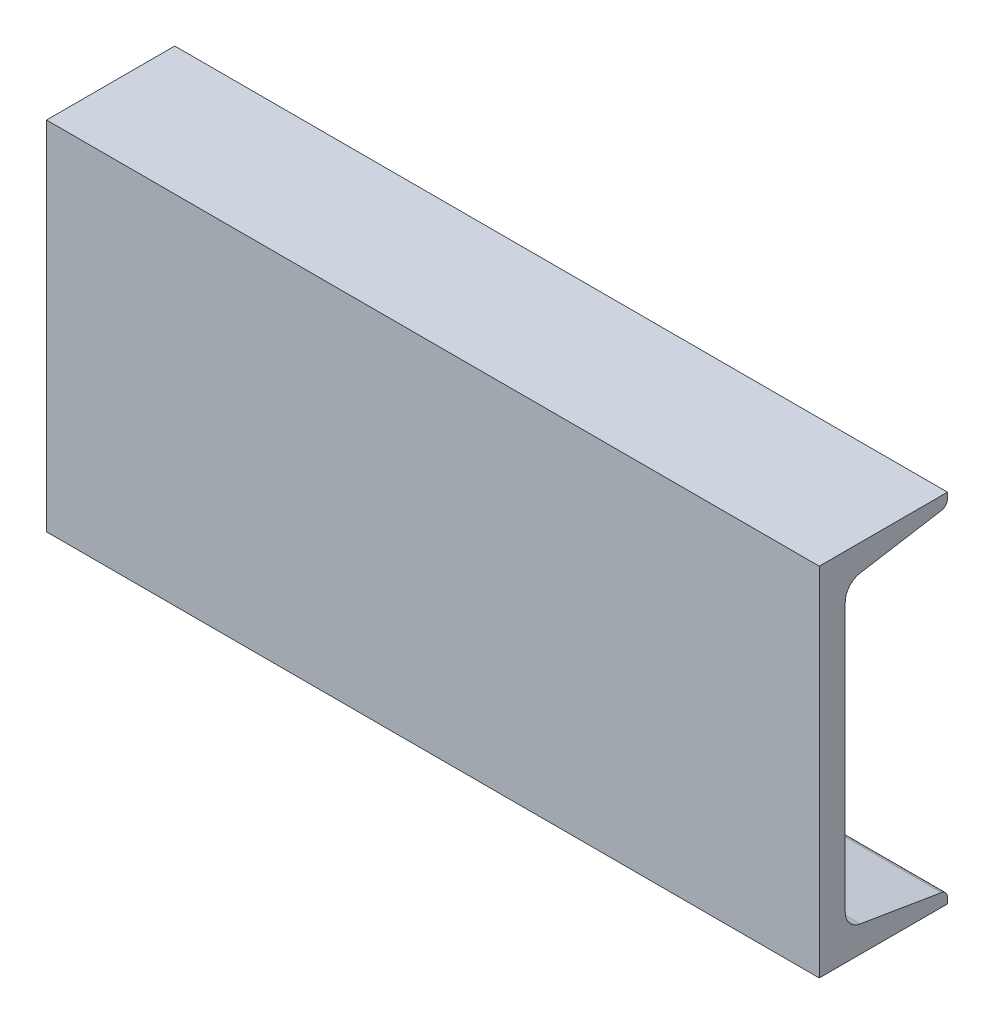
ISO-10303-21;
HEADER;
FILE_DESCRIPTION(('STEP AP214'),'2;1');
FILE_NAME('part.step','',(''),(''),'','','');
FILE_SCHEMA(('AUTOMOTIVE_DESIGN { 1 0 10303 214 1 1 1 1 }'));
ENDSEC;
DATA;
#1=APPLICATION_CONTEXT('core data for automotive mechanical design processes');
#2=APPLICATION_PROTOCOL_DEFINITION('international standard','automotive_design',2000,#1);
#3=PRODUCT_CONTEXT('',#1,'mechanical');
#4=PRODUCT('Part','Part','',(#3));
#5=PRODUCT_RELATED_PRODUCT_CATEGORY('part','',(#4));
#6=PRODUCT_DEFINITION_FORMATION('','',#4);
#7=PRODUCT_DEFINITION_CONTEXT('part definition',#1,'design');
#8=PRODUCT_DEFINITION('design','',#6,#7);
#9=PRODUCT_DEFINITION_SHAPE('','',#8);
#10=(LENGTH_UNIT() NAMED_UNIT(*) SI_UNIT(.MILLI.,.METRE.));
#11=(NAMED_UNIT(*) PLANE_ANGLE_UNIT() SI_UNIT($,.RADIAN.));
#12=(NAMED_UNIT(*) SI_UNIT($,.STERADIAN.) SOLID_ANGLE_UNIT());
#13=UNCERTAINTY_MEASURE_WITH_UNIT(LENGTH_MEASURE(1.E-05),#10,'distance_accuracy_value','');
#14=(GEOMETRIC_REPRESENTATION_CONTEXT(3) GLOBAL_UNCERTAINTY_ASSIGNED_CONTEXT((#13)) GLOBAL_UNIT_ASSIGNED_CONTEXT((#10,
#11,#12)) REPRESENTATION_CONTEXT('',''));
#15=CARTESIAN_POINT('',(0.,0.,0.));
#16=DIRECTION('',(0.,0.,1.));
#17=DIRECTION('',(1.,0.,0.));
#18=AXIS2_PLACEMENT_3D('',#15,#16,#17);
#19=CARTESIAN_POINT('',(165.1,-76.2,27.3939));
#20=DIRECTION('',(0.,1.,0.));
#21=DIRECTION('',(0.,0.,1.));
#22=AXIS2_PLACEMENT_3D('',#19,#20,#21);
#23=PLANE('',#22);
#24=DIRECTION('',(0.,0.,-1.));
#25=VECTOR('',#24,1.);
#26=CARTESIAN_POINT('',(-165.1,-76.2,27.3939));
#27=LINE('',#26,#25);
#28=CARTESIAN_POINT('',(-165.1,-76.2,27.3939));
#29=VERTEX_POINT('',#28);
#30=CARTESIAN_POINT('',(-165.1,-76.2,-27.3939));
#31=VERTEX_POINT('',#30);
#32=EDGE_CURVE('E137',#29,#31,#27,.T.);
#33=ORIENTED_EDGE('',*,*,#32,.T.);
#34=DIRECTION('',(-1.,0.,0.));
#35=VECTOR('',#34,1.);
#36=CARTESIAN_POINT('',(165.1,-76.2,-27.3939));
#37=LINE('',#36,#35);
#38=CARTESIAN_POINT('',(165.1,-76.2,-27.3939));
#39=VERTEX_POINT('',#38);
#40=EDGE_CURVE('E11',#39,#31,#37,.T.);
#41=ORIENTED_EDGE('',*,*,#40,.F.);
#42=DIRECTION('',(0.,0.,-1.));
#43=VECTOR('',#42,1.);
#44=CARTESIAN_POINT('',(165.1,-76.2,27.3939));
#45=LINE('',#44,#43);
#46=CARTESIAN_POINT('',(165.1,-76.2,27.3939));
#47=VERTEX_POINT('',#46);
#48=EDGE_CURVE('E159',#47,#39,#45,.T.);
#49=ORIENTED_EDGE('',*,*,#48,.F.);
#50=DIRECTION('',(-1.,0.,0.));
#51=VECTOR('',#50,1.);
#52=CARTESIAN_POINT('',(165.1,-76.2,27.3939));
#53=LINE('',#52,#51);
#54=EDGE_CURVE('E133',#47,#29,#53,.T.);
#55=ORIENTED_EDGE('',*,*,#54,.T.);
#56=EDGE_LOOP('',(#33,#41,#49,#55));
#57=FACE_BOUND('',#56,.T.);
#58=ADVANCED_FACE('F17',(#57),#23,.F.);
#59=CARTESIAN_POINT('',(165.1,-76.2,-27.3939));
#60=DIRECTION('',(0.,0.,1.));
#61=DIRECTION('',(1.,0.,0.));
#62=AXIS2_PLACEMENT_3D('',#59,#60,#61);
#63=PLANE('',#62);
#64=DIRECTION('',(0.,1.,0.));
#65=VECTOR('',#64,1.);
#66=CARTESIAN_POINT('',(-165.1,-76.2,-27.3939));
#67=LINE('',#66,#65);
#68=CARTESIAN_POINT('',(-165.1,-73.7107446530364,-27.3939));
#69=VERTEX_POINT('',#68);
#70=EDGE_CURVE('E140',#31,#69,#67,.T.);
#71=ORIENTED_EDGE('',*,*,#70,.T.);
#72=DIRECTION('',(-1.,0.,0.));
#73=VECTOR('',#72,1.);
#74=CARTESIAN_POINT('',(165.1,-73.7107446530364,-27.3939));
#75=LINE('',#74,#73);
#76=CARTESIAN_POINT('',(165.1,-73.7107446530364,-27.3939));
#77=VERTEX_POINT('',#76);
#78=EDGE_CURVE('E25',#77,#69,#75,.T.);
#79=ORIENTED_EDGE('',*,*,#78,.F.);
#80=DIRECTION('',(0.,1.,0.));
#81=VECTOR('',#80,1.);
#82=CARTESIAN_POINT('',(165.1,-76.2,-27.3939));
#83=LINE('',#82,#81);
#84=EDGE_CURVE('E88',#39,#77,#83,.T.);
#85=ORIENTED_EDGE('',*,*,#84,.F.);
#86=ORIENTED_EDGE('',*,*,#40,.T.);
#87=EDGE_LOOP('',(#71,#79,#85,#86));
#88=FACE_BOUND('',#87,.T.);
#89=ADVANCED_FACE('F239',(#88),#63,.F.);
#90=CARTESIAN_POINT('',(165.1,-73.7107446530364,-24.3459));
#91=DIRECTION('',(-1.,0.,0.));
#92=DIRECTION('',(0.,0.,1.));
#93=AXIS2_PLACEMENT_3D('',#90,#91,#92);
#94=CYLINDRICAL_SURFACE('',#93,3.048);
#95=CARTESIAN_POINT('',(-165.1,-73.7107446530364,-24.3459));
#96=DIRECTION('',(1.,0.,0.));
#97=DIRECTION('',(0.,0.,-1.));
#98=AXIS2_PLACEMENT_3D('',#95,#96,#97);
#99=CIRCLE('',#98,3.048);
#100=CARTESIAN_POINT('',(-165.1,-70.7042219011292,-24.8470236796088));
#101=VERTEX_POINT('',#100);
#102=EDGE_CURVE('E142',#69,#101,#99,.T.);
#103=ORIENTED_EDGE('',*,*,#102,.T.);
#104=DIRECTION('',(-1.,0.,0.));
#105=VECTOR('',#104,1.);
#106=CARTESIAN_POINT('',(165.1,-70.7042219011292,-24.8470236796088));
#107=LINE('',#106,#105);
#108=CARTESIAN_POINT('',(165.1,-70.7042219011292,-24.8470236796088));
#109=VERTEX_POINT('',#108);
#110=EDGE_CURVE('E178',#109,#101,#107,.T.);
#111=ORIENTED_EDGE('',*,*,#110,.F.);
#112=CARTESIAN_POINT('',(165.1,-73.7107446530364,-24.3459));
#113=DIRECTION('',(1.,0.,0.));
#114=DIRECTION('',(0.,0.,-1.));
#115=AXIS2_PLACEMENT_3D('',#112,#113,#114);
#116=CIRCLE('',#115,3.048);
#117=EDGE_CURVE('E186',#77,#109,#116,.T.);
#118=ORIENTED_EDGE('',*,*,#117,.F.);
#119=ORIENTED_EDGE('',*,*,#78,.T.);
#120=EDGE_LOOP('',(#103,#111,#118,#119));
#121=FACE_BOUND('',#120,.T.);
#122=ADVANCED_FACE('F184',(#121),#94,.T.);
#123=CARTESIAN_POINT('',(165.1,-64.908143628462,9.92690919902199));
#124=DIRECTION('',(0.,-0.986391978972162,0.164410656039631));
#125=DIRECTION('',(0.,-0.164410656039631,-0.986391978972162));
#126=AXIS2_PLACEMENT_3D('',#123,#124,#125);
#127=PLANE('',#126);
#128=DIRECTION('',(0.,0.164410656039631,0.986391978972162));
#129=VECTOR('',#128,1.);
#130=CARTESIAN_POINT('',(-165.1,-64.908143628462,9.92690919902199));
#131=LINE('',#130,#129);
#132=CARTESIAN_POINT('',(-165.1,-64.908143628462,9.92690919902199));
#133=VERTEX_POINT('',#132);
#134=EDGE_CURVE('E144',#101,#133,#131,.T.);
#135=ORIENTED_EDGE('',*,*,#134,.T.);
#136=DIRECTION('',(-1.,0.,0.));
#137=VECTOR('',#136,1.);
#138=CARTESIAN_POINT('',(165.1,-64.908143628462,9.92690919902199));
#139=LINE('',#138,#137);
#140=CARTESIAN_POINT('',(165.1,-64.908143628462,9.92690919902199));
#141=VERTEX_POINT('',#140);
#142=EDGE_CURVE('E175',#141,#133,#139,.T.);
#143=ORIENTED_EDGE('',*,*,#142,.F.);
#144=DIRECTION('',(0.,0.164410656039631,0.986391978972162));
#145=VECTOR('',#144,1.);
#146=CARTESIAN_POINT('',(165.1,-64.908143628462,9.92690919902199));
#147=LINE('',#146,#145);
#148=EDGE_CURVE('E204',#109,#141,#147,.T.);
#149=ORIENTED_EDGE('',*,*,#148,.F.);
#150=ORIENTED_EDGE('',*,*,#110,.T.);
#151=EDGE_LOOP('',(#135,#143,#149,#150));
#152=FACE_BOUND('',#151,.T.);
#153=ADVANCED_FACE('F195',(#152),#127,.F.);
#154=CARTESIAN_POINT('',(165.1,-57.3918367486941,8.6741));
#155=DIRECTION('',(-1.,0.,0.));
#156=DIRECTION('',(0.,0.,1.));
#157=AXIS2_PLACEMENT_3D('',#154,#155,#156);
#158=CYLINDRICAL_SURFACE('',#157,7.62);
#159=CARTESIAN_POINT('',(-165.1,-57.3918367486941,8.6741));
#160=DIRECTION('',(-1.,0.,0.));
#161=DIRECTION('',(0.,0.,-1.));
#162=AXIS2_PLACEMENT_3D('',#159,#160,#161);
#163=CIRCLE('',#162,7.62);
#164=CARTESIAN_POINT('',(-165.1,-57.3918367486941,16.2941));
#165=VERTEX_POINT('',#164);
#166=EDGE_CURVE('E146',#133,#165,#163,.T.);
#167=ORIENTED_EDGE('',*,*,#166,.T.);
#168=DIRECTION('',(-1.,0.,0.));
#169=VECTOR('',#168,1.);
#170=CARTESIAN_POINT('',(165.1,-57.3918367486941,16.2941));
#171=LINE('',#170,#169);
#172=CARTESIAN_POINT('',(165.1,-57.3918367486941,16.2941));
#173=VERTEX_POINT('',#172);
#174=EDGE_CURVE('E172',#173,#165,#171,.T.);
#175=ORIENTED_EDGE('',*,*,#174,.F.);
#176=CARTESIAN_POINT('',(165.1,-57.3918367486941,8.6741));
#177=DIRECTION('',(-1.,0.,0.));
#178=DIRECTION('',(0.,0.,-1.));
#179=AXIS2_PLACEMENT_3D('',#176,#177,#178);
#180=CIRCLE('',#179,7.62);
#181=EDGE_CURVE('E201',#141,#173,#180,.T.);
#182=ORIENTED_EDGE('',*,*,#181,.F.);
#183=ORIENTED_EDGE('',*,*,#142,.T.);
#184=EDGE_LOOP('',(#167,#175,#182,#183));
#185=FACE_BOUND('',#184,.T.);
#186=ADVANCED_FACE('F199',(#185),#158,.F.);
#187=CARTESIAN_POINT('',(165.1,57.3918367486941,16.2941));
#188=DIRECTION('',(0.,0.,1.));
#189=DIRECTION('',(0.,-1.,0.));
#190=AXIS2_PLACEMENT_3D('',#187,#188,#189);
#191=PLANE('',#190);
#192=DIRECTION('',(0.,1.,0.));
#193=VECTOR('',#192,1.);
#194=CARTESIAN_POINT('',(-165.1,57.3918367486941,16.2941));
#195=LINE('',#194,#193);
#196=CARTESIAN_POINT('',(-165.1,57.3918367486941,16.2941));
#197=VERTEX_POINT('',#196);
#198=EDGE_CURVE('E148',#165,#197,#195,.T.);
#199=ORIENTED_EDGE('',*,*,#198,.T.);
#200=DIRECTION('',(-1.,0.,0.));
#201=VECTOR('',#200,1.);
#202=CARTESIAN_POINT('',(165.1,57.3918367486941,16.2941));
#203=LINE('',#202,#201);
#204=CARTESIAN_POINT('',(165.1,57.3918367486941,16.2941));
#205=VERTEX_POINT('',#204);
#206=EDGE_CURVE('E169',#205,#197,#203,.T.);
#207=ORIENTED_EDGE('',*,*,#206,.F.);
#208=DIRECTION('',(0.,1.,0.));
#209=VECTOR('',#208,1.);
#210=CARTESIAN_POINT('',(165.1,57.3918367486941,16.2941));
#211=LINE('',#210,#209);
#212=EDGE_CURVE('E203',#173,#205,#211,.T.);
#213=ORIENTED_EDGE('',*,*,#212,.F.);
#214=ORIENTED_EDGE('',*,*,#174,.T.);
#215=EDGE_LOOP('',(#199,#207,#213,#214));
#216=FACE_BOUND('',#215,.T.);
#217=ADVANCED_FACE('F254',(#216),#191,.F.);
#218=CARTESIAN_POINT('',(165.1,57.3918367486941,8.6741));
#219=DIRECTION('',(-1.,0.,0.));
#220=DIRECTION('',(0.,0.,1.));
#221=AXIS2_PLACEMENT_3D('',#218,#219,#220);
#222=CYLINDRICAL_SURFACE('',#221,7.62);
#223=CARTESIAN_POINT('',(-165.1,57.3918367486941,8.6741));
#224=DIRECTION('',(-1.,0.,0.));
#225=DIRECTION('',(0.,0.,1.));
#226=AXIS2_PLACEMENT_3D('',#223,#224,#225);
#227=CIRCLE('',#226,7.62);
#228=CARTESIAN_POINT('',(-165.1,64.908143628462,9.92690919902198));
#229=VERTEX_POINT('',#228);
#230=EDGE_CURVE('E150',#197,#229,#227,.T.);
#231=ORIENTED_EDGE('',*,*,#230,.T.);
#232=DIRECTION('',(-1.,0.,0.));
#233=VECTOR('',#232,1.);
#234=CARTESIAN_POINT('',(165.1,64.908143628462,9.92690919902198));
#235=LINE('',#234,#233);
#236=CARTESIAN_POINT('',(165.1,64.908143628462,9.92690919902198));
#237=VERTEX_POINT('',#236);
#238=EDGE_CURVE('E166',#237,#229,#235,.T.);
#239=ORIENTED_EDGE('',*,*,#238,.F.);
#240=CARTESIAN_POINT('',(165.1,57.3918367486941,8.6741));
#241=DIRECTION('',(-1.,0.,0.));
#242=DIRECTION('',(0.,0.,1.));
#243=AXIS2_PLACEMENT_3D('',#240,#241,#242);
#244=CIRCLE('',#243,7.62);
#245=EDGE_CURVE('E206',#205,#237,#244,.T.);
#246=ORIENTED_EDGE('',*,*,#245,.F.);
#247=ORIENTED_EDGE('',*,*,#206,.T.);
#248=EDGE_LOOP('',(#231,#239,#246,#247));
#249=FACE_BOUND('',#248,.T.);
#250=ADVANCED_FACE('F257',(#249),#222,.F.);
#251=CARTESIAN_POINT('',(165.1,64.908143628462,9.92690919902198));
#252=DIRECTION('',(0.,0.986391978972162,0.16441065603963));
#253=DIRECTION('',(0.,-0.16441065603963,0.986391978972162));
#254=AXIS2_PLACEMENT_3D('',#251,#252,#253);
#255=PLANE('',#254);
#256=DIRECTION('',(0.,0.16441065603963,-0.986391978972162));
#257=VECTOR('',#256,1.);
#258=CARTESIAN_POINT('',(-165.1,64.908143628462,9.92690919902198));
#259=LINE('',#258,#257);
#260=CARTESIAN_POINT('',(-165.1,70.7042219011292,-24.8470236796088));
#261=VERTEX_POINT('',#260);
#262=EDGE_CURVE('E152',#229,#261,#259,.T.);
#263=ORIENTED_EDGE('',*,*,#262,.T.);
#264=DIRECTION('',(-1.,0.,0.));
#265=VECTOR('',#264,1.);
#266=CARTESIAN_POINT('',(165.1,70.7042219011292,-24.8470236796088));
#267=LINE('',#266,#265);
#268=CARTESIAN_POINT('',(165.1,70.7042219011292,-24.8470236796088));
#269=VERTEX_POINT('',#268);
#270=EDGE_CURVE('E163',#269,#261,#267,.T.);
#271=ORIENTED_EDGE('',*,*,#270,.F.);
#272=DIRECTION('',(0.,0.16441065603963,-0.986391978972162));
#273=VECTOR('',#272,1.);
#274=CARTESIAN_POINT('',(165.1,64.908143628462,9.92690919902198));
#275=LINE('',#274,#273);
#276=EDGE_CURVE('E212',#237,#269,#275,.T.);
#277=ORIENTED_EDGE('',*,*,#276,.F.);
#278=ORIENTED_EDGE('',*,*,#238,.T.);
#279=EDGE_LOOP('',(#263,#271,#277,#278));
#280=FACE_BOUND('',#279,.T.);
#281=ADVANCED_FACE('F218',(#280),#255,.F.);
#282=CARTESIAN_POINT('',(165.1,73.7107446530364,-24.3459));
#283=DIRECTION('',(-1.,0.,0.));
#284=DIRECTION('',(0.,0.,1.));
#285=AXIS2_PLACEMENT_3D('',#282,#283,#284);
#286=CYLINDRICAL_SURFACE('',#285,3.048);
#287=CARTESIAN_POINT('',(-165.1,73.7107446530364,-24.3459));
#288=DIRECTION('',(1.,0.,0.));
#289=DIRECTION('',(0.,0.,1.));
#290=AXIS2_PLACEMENT_3D('',#287,#288,#289);
#291=CIRCLE('',#290,3.048);
#292=CARTESIAN_POINT('',(-165.1,73.7107446530364,-27.3939));
#293=VERTEX_POINT('',#292);
#294=EDGE_CURVE('E154',#261,#293,#291,.T.);
#295=ORIENTED_EDGE('',*,*,#294,.T.);
#296=DIRECTION('',(-1.,0.,0.));
#297=VECTOR('',#296,1.);
#298=CARTESIAN_POINT('',(165.1,73.7107446530364,-27.3939));
#299=LINE('',#298,#297);
#300=CARTESIAN_POINT('',(165.1,73.7107446530364,-27.3939));
#301=VERTEX_POINT('',#300);
#302=EDGE_CURVE('E128',#301,#293,#299,.T.);
#303=ORIENTED_EDGE('',*,*,#302,.F.);
#304=CARTESIAN_POINT('',(165.1,73.7107446530364,-24.3459));
#305=DIRECTION('',(1.,0.,0.));
#306=DIRECTION('',(0.,0.,1.));
#307=AXIS2_PLACEMENT_3D('',#304,#305,#306);
#308=CIRCLE('',#307,3.048);
#309=EDGE_CURVE('E119',#269,#301,#308,.T.);
#310=ORIENTED_EDGE('',*,*,#309,.F.);
#311=ORIENTED_EDGE('',*,*,#270,.T.);
#312=EDGE_LOOP('',(#295,#303,#310,#311));
#313=FACE_BOUND('',#312,.T.);
#314=ADVANCED_FACE('F222',(#313),#286,.T.);
#315=CARTESIAN_POINT('',(165.1,76.2,-27.3939));
#316=DIRECTION('',(0.,0.,1.));
#317=DIRECTION('',(0.,-1.,0.));
#318=AXIS2_PLACEMENT_3D('',#315,#316,#317);
#319=PLANE('',#318);
#320=DIRECTION('',(0.,1.,0.));
#321=VECTOR('',#320,1.);
#322=CARTESIAN_POINT('',(-165.1,76.2,-27.3939));
#323=LINE('',#322,#321);
#324=CARTESIAN_POINT('',(-165.1,76.2,-27.3939));
#325=VERTEX_POINT('',#324);
#326=EDGE_CURVE('E127',#293,#325,#323,.T.);
#327=ORIENTED_EDGE('',*,*,#326,.T.);
#328=DIRECTION('',(-1.,0.,0.));
#329=VECTOR('',#328,1.);
#330=CARTESIAN_POINT('',(165.1,76.2,-27.3939));
#331=LINE('',#330,#329);
#332=CARTESIAN_POINT('',(165.1,76.2,-27.3939));
#333=VERTEX_POINT('',#332);
#334=EDGE_CURVE('E124',#333,#325,#331,.T.);
#335=ORIENTED_EDGE('',*,*,#334,.F.);
#336=DIRECTION('',(0.,1.,0.));
#337=VECTOR('',#336,1.);
#338=CARTESIAN_POINT('',(165.1,76.2,-27.3939));
#339=LINE('',#338,#337);
#340=EDGE_CURVE('E113',#301,#333,#339,.T.);
#341=ORIENTED_EDGE('',*,*,#340,.F.);
#342=ORIENTED_EDGE('',*,*,#302,.T.);
#343=EDGE_LOOP('',(#327,#335,#341,#342));
#344=FACE_BOUND('',#343,.T.);
#345=ADVANCED_FACE('F125',(#344),#319,.F.);
#346=CARTESIAN_POINT('',(165.1,76.2,27.3939));
#347=DIRECTION('',(0.,-1.,0.));
#348=DIRECTION('',(0.,0.,-1.));
#349=AXIS2_PLACEMENT_3D('',#346,#347,#348);
#350=PLANE('',#349);
#351=DIRECTION('',(0.,0.,1.));
#352=VECTOR('',#351,1.);
#353=CARTESIAN_POINT('',(-165.1,76.2,27.3939));
#354=LINE('',#353,#352);
#355=CARTESIAN_POINT('',(-165.1,76.2,27.3939));
#356=VERTEX_POINT('',#355);
#357=EDGE_CURVE('E74',#325,#356,#354,.T.);
#358=ORIENTED_EDGE('',*,*,#357,.T.);
#359=DIRECTION('',(-1.,0.,0.));
#360=VECTOR('',#359,1.);
#361=CARTESIAN_POINT('',(165.1,76.2,27.3939));
#362=LINE('',#361,#360);
#363=CARTESIAN_POINT('',(165.1,76.2,27.3939));
#364=VERTEX_POINT('',#363);
#365=EDGE_CURVE('E129',#364,#356,#362,.T.);
#366=ORIENTED_EDGE('',*,*,#365,.F.);
#367=DIRECTION('',(0.,0.,1.));
#368=VECTOR('',#367,1.);
#369=CARTESIAN_POINT('',(165.1,76.2,27.3939));
#370=LINE('',#369,#368);
#371=EDGE_CURVE('E117',#333,#364,#370,.T.);
#372=ORIENTED_EDGE('',*,*,#371,.F.);
#373=ORIENTED_EDGE('',*,*,#334,.T.);
#374=EDGE_LOOP('',(#358,#366,#372,#373));
#375=FACE_BOUND('',#374,.T.);
#376=ADVANCED_FACE('F131',(#375),#350,.F.);
#377=CARTESIAN_POINT('',(165.1,-76.2,27.3939));
#378=DIRECTION('',(0.,0.,-1.));
#379=DIRECTION('',(-1.,0.,0.));
#380=AXIS2_PLACEMENT_3D('',#377,#378,#379);
#381=PLANE('',#380);
#382=DIRECTION('',(0.,-1.,0.));
#383=VECTOR('',#382,1.);
#384=CARTESIAN_POINT('',(-165.1,-76.2,27.3939));
#385=LINE('',#384,#383);
#386=EDGE_CURVE('E80',#356,#29,#385,.T.);
#387=ORIENTED_EDGE('',*,*,#386,.T.);
#388=ORIENTED_EDGE('',*,*,#54,.F.);
#389=DIRECTION('',(0.,-1.,0.));
#390=VECTOR('',#389,1.);
#391=CARTESIAN_POINT('',(165.1,-76.2,27.3939));
#392=LINE('',#391,#390);
#393=EDGE_CURVE('E33',#364,#47,#392,.T.);
#394=ORIENTED_EDGE('',*,*,#393,.F.);
#395=ORIENTED_EDGE('',*,*,#365,.T.);
#396=EDGE_LOOP('',(#387,#388,#394,#395));
#397=FACE_BOUND('',#396,.T.);
#398=ADVANCED_FACE('F226',(#397),#381,.F.);
#399=CARTESIAN_POINT('',(165.1,-73.7107446530364,-24.3459));
#400=DIRECTION('',(1.,0.,0.));
#401=DIRECTION('',(0.,0.,-1.));
#402=AXIS2_PLACEMENT_3D('',#399,#400,#401);
#403=PLANE('',#402);
#404=ORIENTED_EDGE('',*,*,#48,.T.);
#405=ORIENTED_EDGE('',*,*,#84,.T.);
#406=ORIENTED_EDGE('',*,*,#117,.T.);
#407=ORIENTED_EDGE('',*,*,#148,.T.);
#408=ORIENTED_EDGE('',*,*,#181,.T.);
#409=ORIENTED_EDGE('',*,*,#212,.T.);
#410=ORIENTED_EDGE('',*,*,#245,.T.);
#411=ORIENTED_EDGE('',*,*,#276,.T.);
#412=ORIENTED_EDGE('',*,*,#309,.T.);
#413=ORIENTED_EDGE('',*,*,#340,.T.);
#414=ORIENTED_EDGE('',*,*,#371,.T.);
#415=ORIENTED_EDGE('',*,*,#393,.T.);
#416=EDGE_LOOP('',(#404,#405,#406,#407,#408,#409,#410,#411,#412,#413,#414,#415));
#417=FACE_BOUND('',#416,.T.);
#418=ADVANCED_FACE('F115',(#417),#403,.T.);
#419=CARTESIAN_POINT('',(-165.1,-73.7107446530364,-24.3459));
#420=DIRECTION('',(1.,0.,0.));
#421=DIRECTION('',(0.,0.,-1.));
#422=AXIS2_PLACEMENT_3D('',#419,#420,#421);
#423=PLANE('',#422);
#424=ORIENTED_EDGE('',*,*,#32,.F.);
#425=ORIENTED_EDGE('',*,*,#386,.F.);
#426=ORIENTED_EDGE('',*,*,#357,.F.);
#427=ORIENTED_EDGE('',*,*,#326,.F.);
#428=ORIENTED_EDGE('',*,*,#294,.F.);
#429=ORIENTED_EDGE('',*,*,#262,.F.);
#430=ORIENTED_EDGE('',*,*,#230,.F.);
#431=ORIENTED_EDGE('',*,*,#198,.F.);
#432=ORIENTED_EDGE('',*,*,#166,.F.);
#433=ORIENTED_EDGE('',*,*,#134,.F.);
#434=ORIENTED_EDGE('',*,*,#102,.F.);
#435=ORIENTED_EDGE('',*,*,#70,.F.);
#436=EDGE_LOOP('',(#424,#425,#426,#427,#428,#429,#430,#431,#432,#433,#434,#435));
#437=FACE_BOUND('',#436,.T.);
#438=ADVANCED_FACE('F190',(#437),#423,.F.);
#439=CLOSED_SHELL('',(#58,#89,#122,#153,#186,#217,#250,#281,#314,#345,#376,#398,#418,#438));
#440=MANIFOLD_SOLID_BREP('B1',#439);
#441=ADVANCED_BREP_SHAPE_REPRESENTATION('',(#18,#440),#14);
#442=SHAPE_DEFINITION_REPRESENTATION(#9,#441);
ENDSEC;
END-ISO-10303-21;
